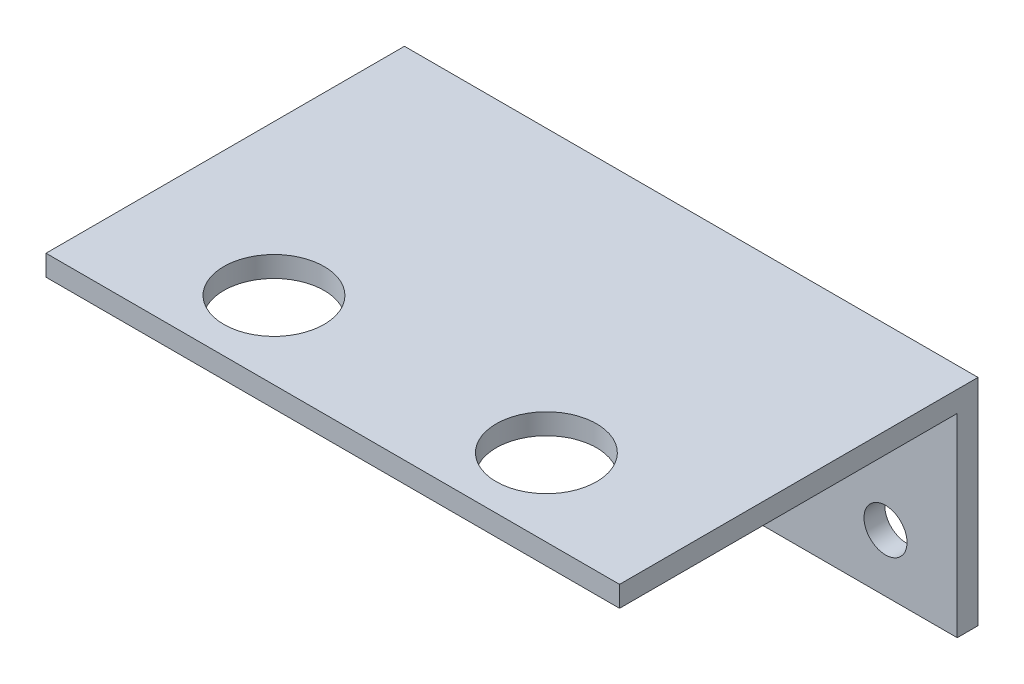
ISO-10303-21;
HEADER;
FILE_DESCRIPTION(('STEP AP214'),'2;1');
FILE_NAME('part.step','',(''),(''),'','','');
FILE_SCHEMA(('AUTOMOTIVE_DESIGN { 1 0 10303 214 1 1 1 1 }'));
ENDSEC;
DATA;
#1=APPLICATION_CONTEXT('core data for automotive mechanical design processes');
#2=APPLICATION_PROTOCOL_DEFINITION('international standard','automotive_design',2000,#1);
#3=PRODUCT_CONTEXT('',#1,'mechanical');
#4=PRODUCT('Part','Part','',(#3));
#5=PRODUCT_RELATED_PRODUCT_CATEGORY('part','',(#4));
#6=PRODUCT_DEFINITION_FORMATION('','',#4);
#7=PRODUCT_DEFINITION_CONTEXT('part definition',#1,'design');
#8=PRODUCT_DEFINITION('design','',#6,#7);
#9=PRODUCT_DEFINITION_SHAPE('','',#8);
#10=(LENGTH_UNIT() NAMED_UNIT(*) SI_UNIT(.MILLI.,.METRE.));
#11=(NAMED_UNIT(*) PLANE_ANGLE_UNIT() SI_UNIT($,.RADIAN.));
#12=(NAMED_UNIT(*) SI_UNIT($,.STERADIAN.) SOLID_ANGLE_UNIT());
#13=UNCERTAINTY_MEASURE_WITH_UNIT(LENGTH_MEASURE(1.E-05),#10,'distance_accuracy_value','');
#14=(GEOMETRIC_REPRESENTATION_CONTEXT(3) GLOBAL_UNCERTAINTY_ASSIGNED_CONTEXT((#13)) GLOBAL_UNIT_ASSIGNED_CONTEXT((#10,
#11,#12)) REPRESENTATION_CONTEXT('',''));
#15=CARTESIAN_POINT('',(0.,0.,0.));
#16=DIRECTION('',(0.,0.,1.));
#17=DIRECTION('',(1.,0.,0.));
#18=AXIS2_PLACEMENT_3D('',#15,#16,#17);
#19=CARTESIAN_POINT('',(0.,0.,1.45));
#20=DIRECTION('',(0.,0.,-1.));
#21=DIRECTION('',(-1.,0.,0.));
#22=AXIS2_PLACEMENT_3D('',#19,#20,#21);
#23=PLANE('',#22);
#24=CARTESIAN_POINT('',(15.,-3.5,1.45));
#25=DIRECTION('',(0.,0.,-1.));
#26=DIRECTION('',(-1.,0.,0.));
#27=AXIS2_PLACEMENT_3D('',#24,#25,#26);
#28=CIRCLE('',#27,1.5);
#29=CARTESIAN_POINT('',(13.5,-3.5,1.45));
#30=VERTEX_POINT('',#29);
#31=EDGE_CURVE('E178',#30,#30,#28,.T.);
#32=ORIENTED_EDGE('',*,*,#31,.T.);
#33=EDGE_LOOP('',(#32));
#34=FACE_BOUND('',#33,.T.);
#35=CARTESIAN_POINT('',(-15.,-3.5,1.45));
#36=DIRECTION('',(0.,0.,1.));
#37=DIRECTION('',(1.,0.,0.));
#38=AXIS2_PLACEMENT_3D('',#35,#36,#37);
#39=CIRCLE('',#38,1.5);
#40=CARTESIAN_POINT('',(-13.5,-3.5,1.45));
#41=VERTEX_POINT('',#40);
#42=EDGE_CURVE('E150',#41,#41,#39,.T.);
#43=ORIENTED_EDGE('',*,*,#42,.F.);
#44=EDGE_LOOP('',(#43));
#45=FACE_BOUND('',#44,.T.);
#46=DIRECTION('',(1.,0.,0.));
#47=VECTOR('',#46,1.);
#48=CARTESIAN_POINT('',(-20.,6.05,1.45));
#49=LINE('',#48,#47);
#50=CARTESIAN_POINT('',(-20.,6.05,1.45));
#51=VERTEX_POINT('',#50);
#52=CARTESIAN_POINT('',(20.,6.05,1.45));
#53=VERTEX_POINT('',#52);
#54=EDGE_CURVE('E54',#51,#53,#49,.T.);
#55=ORIENTED_EDGE('',*,*,#54,.F.);
#56=DIRECTION('',(0.,-1.,0.));
#57=VECTOR('',#56,1.);
#58=CARTESIAN_POINT('',(-20.,-7.5,1.45));
#59=LINE('',#58,#57);
#60=CARTESIAN_POINT('',(-20.,-7.5,1.45));
#61=VERTEX_POINT('',#60);
#62=EDGE_CURVE('E153',#51,#61,#59,.T.);
#63=ORIENTED_EDGE('',*,*,#62,.T.);
#64=DIRECTION('',(1.,0.,0.));
#65=VECTOR('',#64,1.);
#66=CARTESIAN_POINT('',(-20.,-7.5,1.45));
#67=LINE('',#66,#65);
#68=CARTESIAN_POINT('',(20.,-7.5,1.45));
#69=VERTEX_POINT('',#68);
#70=EDGE_CURVE('E60',#61,#69,#67,.T.);
#71=ORIENTED_EDGE('',*,*,#70,.T.);
#72=DIRECTION('',(0.,1.,0.));
#73=VECTOR('',#72,1.);
#74=CARTESIAN_POINT('',(20.,-7.5,1.45));
#75=LINE('',#74,#73);
#76=EDGE_CURVE('E90',#69,#53,#75,.T.);
#77=ORIENTED_EDGE('',*,*,#76,.T.);
#78=EDGE_LOOP('',(#55,#63,#71,#77));
#79=FACE_BOUND('',#78,.T.);
#80=ADVANCED_FACE('F38',(#34,#45,#79),#23,.F.);
#81=CARTESIAN_POINT('',(20.,-7.5,1.45));
#82=DIRECTION('',(-1.,0.,0.));
#83=DIRECTION('',(0.,0.,1.));
#84=AXIS2_PLACEMENT_3D('',#81,#82,#83);
#85=PLANE('',#84);
#86=DIRECTION('',(0.,1.,0.));
#87=VECTOR('',#86,1.);
#88=CARTESIAN_POINT('',(20.,-7.5,0.));
#89=LINE('',#88,#87);
#90=CARTESIAN_POINT('',(20.,-7.5,0.));
#91=VERTEX_POINT('',#90);
#92=CARTESIAN_POINT('',(20.,7.5,0.));
#93=VERTEX_POINT('',#92);
#94=EDGE_CURVE('E96',#91,#93,#89,.T.);
#95=ORIENTED_EDGE('',*,*,#94,.T.);
#96=DIRECTION('',(0.,0.,-1.));
#97=VECTOR('',#96,1.);
#98=CARTESIAN_POINT('',(20.,7.5,1.45));
#99=LINE('',#98,#97);
#100=CARTESIAN_POINT('',(20.,7.5,25.));
#101=VERTEX_POINT('',#100);
#102=EDGE_CURVE('E11',#101,#93,#99,.T.);
#103=ORIENTED_EDGE('',*,*,#102,.F.);
#104=DIRECTION('',(0.,1.,0.));
#105=VECTOR('',#104,1.);
#106=CARTESIAN_POINT('',(20.,7.5,25.));
#107=LINE('',#106,#105);
#108=CARTESIAN_POINT('',(20.,6.05,25.));
#109=VERTEX_POINT('',#108);
#110=EDGE_CURVE('E139',#109,#101,#107,.T.);
#111=ORIENTED_EDGE('',*,*,#110,.F.);
#112=DIRECTION('',(0.,0.,-1.));
#113=VECTOR('',#112,1.);
#114=CARTESIAN_POINT('',(20.,6.05,25.));
#115=LINE('',#114,#113);
#116=EDGE_CURVE('E109',#109,#53,#115,.T.);
#117=ORIENTED_EDGE('',*,*,#116,.T.);
#118=ORIENTED_EDGE('',*,*,#76,.F.);
#119=DIRECTION('',(0.,0.,-1.));
#120=VECTOR('',#119,1.);
#121=CARTESIAN_POINT('',(20.,-7.5,1.45));
#122=LINE('',#121,#120);
#123=EDGE_CURVE('E82',#69,#91,#122,.T.);
#124=ORIENTED_EDGE('',*,*,#123,.T.);
#125=EDGE_LOOP('',(#95,#103,#111,#117,#118,#124));
#126=FACE_BOUND('',#125,.T.);
#127=ADVANCED_FACE('F40',(#126),#85,.F.);
#128=CARTESIAN_POINT('',(-20.,7.5,1.45));
#129=DIRECTION('',(0.,-1.,0.));
#130=DIRECTION('',(0.,0.,-1.));
#131=AXIS2_PLACEMENT_3D('',#128,#129,#130);
#132=PLANE('',#131);
#133=CARTESIAN_POINT('',(9.5,7.5,19.6));
#134=DIRECTION('',(0.,-1.,0.));
#135=DIRECTION('',(0.,0.,1.));
#136=AXIS2_PLACEMENT_3D('',#133,#134,#135);
#137=CIRCLE('',#136,3.5);
#138=CARTESIAN_POINT('',(9.5,7.5,23.1));
#139=VERTEX_POINT('',#138);
#140=EDGE_CURVE('E190',#139,#139,#137,.T.);
#141=ORIENTED_EDGE('',*,*,#140,.T.);
#142=EDGE_LOOP('',(#141));
#143=FACE_BOUND('',#142,.T.);
#144=CARTESIAN_POINT('',(-9.5,7.5,19.6));
#145=DIRECTION('',(0.,1.,0.));
#146=DIRECTION('',(0.,0.,1.));
#147=AXIS2_PLACEMENT_3D('',#144,#145,#146);
#148=CIRCLE('',#147,3.5);
#149=CARTESIAN_POINT('',(-9.5,7.5,23.1));
#150=VERTEX_POINT('',#149);
#151=EDGE_CURVE('E186',#150,#150,#148,.T.);
#152=ORIENTED_EDGE('',*,*,#151,.F.);
#153=EDGE_LOOP('',(#152));
#154=FACE_BOUND('',#153,.T.);
#155=DIRECTION('',(-1.,0.,0.));
#156=VECTOR('',#155,1.);
#157=CARTESIAN_POINT('',(-20.,7.5,0.));
#158=LINE('',#157,#156);
#159=CARTESIAN_POINT('',(-20.,7.5,0.));
#160=VERTEX_POINT('',#159);
#161=EDGE_CURVE('E101',#93,#160,#158,.T.);
#162=ORIENTED_EDGE('',*,*,#161,.T.);
#163=DIRECTION('',(0.,0.,-1.));
#164=VECTOR('',#163,1.);
#165=CARTESIAN_POINT('',(-20.,7.5,1.45));
#166=LINE('',#165,#164);
#167=CARTESIAN_POINT('',(-20.,7.5,25.));
#168=VERTEX_POINT('',#167);
#169=EDGE_CURVE('E47',#168,#160,#166,.T.);
#170=ORIENTED_EDGE('',*,*,#169,.F.);
#171=DIRECTION('',(-1.,0.,0.));
#172=VECTOR('',#171,1.);
#173=CARTESIAN_POINT('',(-20.,7.5,25.));
#174=LINE('',#173,#172);
#175=EDGE_CURVE('E131',#101,#168,#174,.T.);
#176=ORIENTED_EDGE('',*,*,#175,.F.);
#177=ORIENTED_EDGE('',*,*,#102,.T.);
#178=EDGE_LOOP('',(#162,#170,#176,#177));
#179=FACE_BOUND('',#178,.T.);
#180=ADVANCED_FACE('F129',(#143,#154,#179),#132,.F.);
#181=CARTESIAN_POINT('',(-20.,-7.5,1.45));
#182=DIRECTION('',(1.,0.,0.));
#183=DIRECTION('',(0.,0.,-1.));
#184=AXIS2_PLACEMENT_3D('',#181,#182,#183);
#185=PLANE('',#184);
#186=DIRECTION('',(0.,-1.,0.));
#187=VECTOR('',#186,1.);
#188=CARTESIAN_POINT('',(-20.,-7.5,0.));
#189=LINE('',#188,#187);
#190=CARTESIAN_POINT('',(-20.,-7.5,0.));
#191=VERTEX_POINT('',#190);
#192=EDGE_CURVE('E91',#160,#191,#189,.T.);
#193=ORIENTED_EDGE('',*,*,#192,.T.);
#194=DIRECTION('',(0.,0.,-1.));
#195=VECTOR('',#194,1.);
#196=CARTESIAN_POINT('',(-20.,-7.5,1.45));
#197=LINE('',#196,#195);
#198=EDGE_CURVE('E85',#61,#191,#197,.T.);
#199=ORIENTED_EDGE('',*,*,#198,.F.);
#200=ORIENTED_EDGE('',*,*,#62,.F.);
#201=DIRECTION('',(0.,0.,-1.));
#202=VECTOR('',#201,1.);
#203=CARTESIAN_POINT('',(-20.,6.05,25.));
#204=LINE('',#203,#202);
#205=CARTESIAN_POINT('',(-20.,6.05,25.));
#206=VERTEX_POINT('',#205);
#207=EDGE_CURVE('E103',#206,#51,#204,.T.);
#208=ORIENTED_EDGE('',*,*,#207,.F.);
#209=DIRECTION('',(0.,-1.,0.));
#210=VECTOR('',#209,1.);
#211=CARTESIAN_POINT('',(-20.,7.5,25.));
#212=LINE('',#211,#210);
#213=EDGE_CURVE('E125',#168,#206,#212,.T.);
#214=ORIENTED_EDGE('',*,*,#213,.F.);
#215=ORIENTED_EDGE('',*,*,#169,.T.);
#216=EDGE_LOOP('',(#193,#199,#200,#208,#214,#215));
#217=FACE_BOUND('',#216,.T.);
#218=ADVANCED_FACE('F122',(#217),#185,.F.);
#219=CARTESIAN_POINT('',(-20.,-7.5,1.45));
#220=DIRECTION('',(0.,1.,0.));
#221=DIRECTION('',(0.,0.,1.));
#222=AXIS2_PLACEMENT_3D('',#219,#220,#221);
#223=PLANE('',#222);
#224=DIRECTION('',(1.,0.,0.));
#225=VECTOR('',#224,1.);
#226=CARTESIAN_POINT('',(-20.,-7.5,0.));
#227=LINE('',#226,#225);
#228=EDGE_CURVE('E79',#191,#91,#227,.T.);
#229=ORIENTED_EDGE('',*,*,#228,.T.);
#230=ORIENTED_EDGE('',*,*,#123,.F.);
#231=ORIENTED_EDGE('',*,*,#70,.F.);
#232=ORIENTED_EDGE('',*,*,#198,.T.);
#233=EDGE_LOOP('',(#229,#230,#231,#232));
#234=FACE_BOUND('',#233,.T.);
#235=ADVANCED_FACE('F81',(#234),#223,.F.);
#236=CARTESIAN_POINT('',(0.,0.,0.));
#237=DIRECTION('',(0.,0.,-1.));
#238=DIRECTION('',(-1.,0.,0.));
#239=AXIS2_PLACEMENT_3D('',#236,#237,#238);
#240=PLANE('',#239);
#241=CARTESIAN_POINT('',(15.,-3.5,0.));
#242=DIRECTION('',(0.,0.,-1.));
#243=DIRECTION('',(-1.,0.,0.));
#244=AXIS2_PLACEMENT_3D('',#241,#242,#243);
#245=CIRCLE('',#244,1.5);
#246=CARTESIAN_POINT('',(13.5,-3.5,0.));
#247=VERTEX_POINT('',#246);
#248=EDGE_CURVE('E171',#247,#247,#245,.T.);
#249=ORIENTED_EDGE('',*,*,#248,.F.);
#250=EDGE_LOOP('',(#249));
#251=FACE_BOUND('',#250,.T.);
#252=CARTESIAN_POINT('',(-15.,-3.5,0.));
#253=DIRECTION('',(0.,0.,-1.));
#254=DIRECTION('',(-1.,0.,0.));
#255=AXIS2_PLACEMENT_3D('',#252,#253,#254);
#256=CIRCLE('',#255,1.5);
#257=CARTESIAN_POINT('',(-16.5,-3.5,0.));
#258=VERTEX_POINT('',#257);
#259=EDGE_CURVE('E167',#258,#258,#256,.F.);
#260=ORIENTED_EDGE('',*,*,#259,.T.);
#261=EDGE_LOOP('',(#260));
#262=FACE_BOUND('',#261,.T.);
#263=ORIENTED_EDGE('',*,*,#94,.F.);
#264=ORIENTED_EDGE('',*,*,#228,.F.);
#265=ORIENTED_EDGE('',*,*,#192,.F.);
#266=ORIENTED_EDGE('',*,*,#161,.F.);
#267=EDGE_LOOP('',(#263,#264,#265,#266));
#268=FACE_BOUND('',#267,.T.);
#269=ADVANCED_FACE('F100',(#251,#262,#268),#240,.T.);
#270=CARTESIAN_POINT('',(-20.,6.05,25.));
#271=DIRECTION('',(0.,1.,0.));
#272=DIRECTION('',(0.,0.,1.));
#273=AXIS2_PLACEMENT_3D('',#270,#271,#272);
#274=PLANE('',#273);
#275=CARTESIAN_POINT('',(9.5,6.05,19.6));
#276=DIRECTION('',(0.,1.,0.));
#277=DIRECTION('',(0.,0.,1.));
#278=AXIS2_PLACEMENT_3D('',#275,#276,#277);
#279=CIRCLE('',#278,3.5);
#280=CARTESIAN_POINT('',(9.5,6.05,23.1));
#281=VERTEX_POINT('',#280);
#282=EDGE_CURVE('E191',#281,#281,#279,.T.);
#283=ORIENTED_EDGE('',*,*,#282,.T.);
#284=EDGE_LOOP('',(#283));
#285=FACE_BOUND('',#284,.T.);
#286=CARTESIAN_POINT('',(-9.5,6.05,19.6));
#287=DIRECTION('',(0.,1.,0.));
#288=DIRECTION('',(0.,0.,1.));
#289=AXIS2_PLACEMENT_3D('',#286,#287,#288);
#290=CIRCLE('',#289,3.5);
#291=CARTESIAN_POINT('',(-9.5,6.05,23.1));
#292=VERTEX_POINT('',#291);
#293=EDGE_CURVE('E182',#292,#292,#290,.F.);
#294=ORIENTED_EDGE('',*,*,#293,.F.);
#295=EDGE_LOOP('',(#294));
#296=FACE_BOUND('',#295,.T.);
#297=ORIENTED_EDGE('',*,*,#54,.T.);
#298=ORIENTED_EDGE('',*,*,#116,.F.);
#299=DIRECTION('',(1.,0.,0.));
#300=VECTOR('',#299,1.);
#301=CARTESIAN_POINT('',(-20.,6.05,25.));
#302=LINE('',#301,#300);
#303=EDGE_CURVE('E145',#206,#109,#302,.T.);
#304=ORIENTED_EDGE('',*,*,#303,.F.);
#305=ORIENTED_EDGE('',*,*,#207,.T.);
#306=EDGE_LOOP('',(#297,#298,#304,#305));
#307=FACE_BOUND('',#306,.T.);
#308=ADVANCED_FACE('F158',(#285,#296,#307),#274,.F.);
#309=CARTESIAN_POINT('',(0.,0.,25.));
#310=DIRECTION('',(0.,0.,1.));
#311=DIRECTION('',(1.,0.,0.));
#312=AXIS2_PLACEMENT_3D('',#309,#310,#311);
#313=PLANE('',#312);
#314=ORIENTED_EDGE('',*,*,#213,.T.);
#315=ORIENTED_EDGE('',*,*,#303,.T.);
#316=ORIENTED_EDGE('',*,*,#110,.T.);
#317=ORIENTED_EDGE('',*,*,#175,.T.);
#318=EDGE_LOOP('',(#314,#315,#316,#317));
#319=FACE_BOUND('',#318,.T.);
#320=ADVANCED_FACE('F135',(#319),#313,.T.);
#321=CARTESIAN_POINT('',(-15.,-3.5,-0.000999999999999916));
#322=DIRECTION('',(0.,0.,1.));
#323=DIRECTION('',(1.,0.,0.));
#324=AXIS2_PLACEMENT_3D('',#321,#322,#323);
#325=CYLINDRICAL_SURFACE('',#324,1.5);
#326=ORIENTED_EDGE('',*,*,#259,.F.);
#327=EDGE_LOOP('',(#326));
#328=FACE_BOUND('',#327,.T.);
#329=ORIENTED_EDGE('',*,*,#42,.T.);
#330=EDGE_LOOP('',(#329));
#331=FACE_BOUND('',#330,.T.);
#332=ADVANCED_FACE('F220',(#328,#331),#325,.F.);
#333=CARTESIAN_POINT('',(15.,-3.5,-0.000999999999999916));
#334=DIRECTION('',(0.,0.,1.));
#335=DIRECTION('',(1.,0.,0.));
#336=AXIS2_PLACEMENT_3D('',#333,#334,#335);
#337=CYLINDRICAL_SURFACE('',#336,1.5);
#338=ORIENTED_EDGE('',*,*,#248,.T.);
#339=EDGE_LOOP('',(#338));
#340=FACE_BOUND('',#339,.T.);
#341=ORIENTED_EDGE('',*,*,#31,.F.);
#342=EDGE_LOOP('',(#341));
#343=FACE_BOUND('',#342,.T.);
#344=ADVANCED_FACE('F214',(#340,#343),#337,.F.);
#345=CARTESIAN_POINT('',(-9.5,-7.501,19.6));
#346=DIRECTION('',(0.,1.,0.));
#347=DIRECTION('',(0.,0.,1.));
#348=AXIS2_PLACEMENT_3D('',#345,#346,#347);
#349=CYLINDRICAL_SURFACE('',#348,3.5);
#350=ORIENTED_EDGE('',*,*,#151,.T.);
#351=EDGE_LOOP('',(#350));
#352=FACE_BOUND('',#351,.T.);
#353=ORIENTED_EDGE('',*,*,#293,.T.);
#354=EDGE_LOOP('',(#353));
#355=FACE_BOUND('',#354,.T.);
#356=ADVANCED_FACE('F204',(#352,#355),#349,.F.);
#357=CARTESIAN_POINT('',(9.5,-7.501,19.6));
#358=DIRECTION('',(0.,1.,0.));
#359=DIRECTION('',(0.,0.,1.));
#360=AXIS2_PLACEMENT_3D('',#357,#358,#359);
#361=CYLINDRICAL_SURFACE('',#360,3.5);
#362=ORIENTED_EDGE('',*,*,#140,.F.);
#363=EDGE_LOOP('',(#362));
#364=FACE_BOUND('',#363,.T.);
#365=ORIENTED_EDGE('',*,*,#282,.F.);
#366=EDGE_LOOP('',(#365));
#367=FACE_BOUND('',#366,.T.);
#368=ADVANCED_FACE('F201',(#364,#367),#361,.F.);
#369=CLOSED_SHELL('',(#80,#127,#180,#218,#235,#269,#308,#320,#332,#344,#356,#368));
#370=MANIFOLD_SOLID_BREP('B2',#369);
#371=ADVANCED_BREP_SHAPE_REPRESENTATION('',(#18,#370),#14);
#372=SHAPE_DEFINITION_REPRESENTATION(#9,#371);
ENDSEC;
END-ISO-10303-21;
